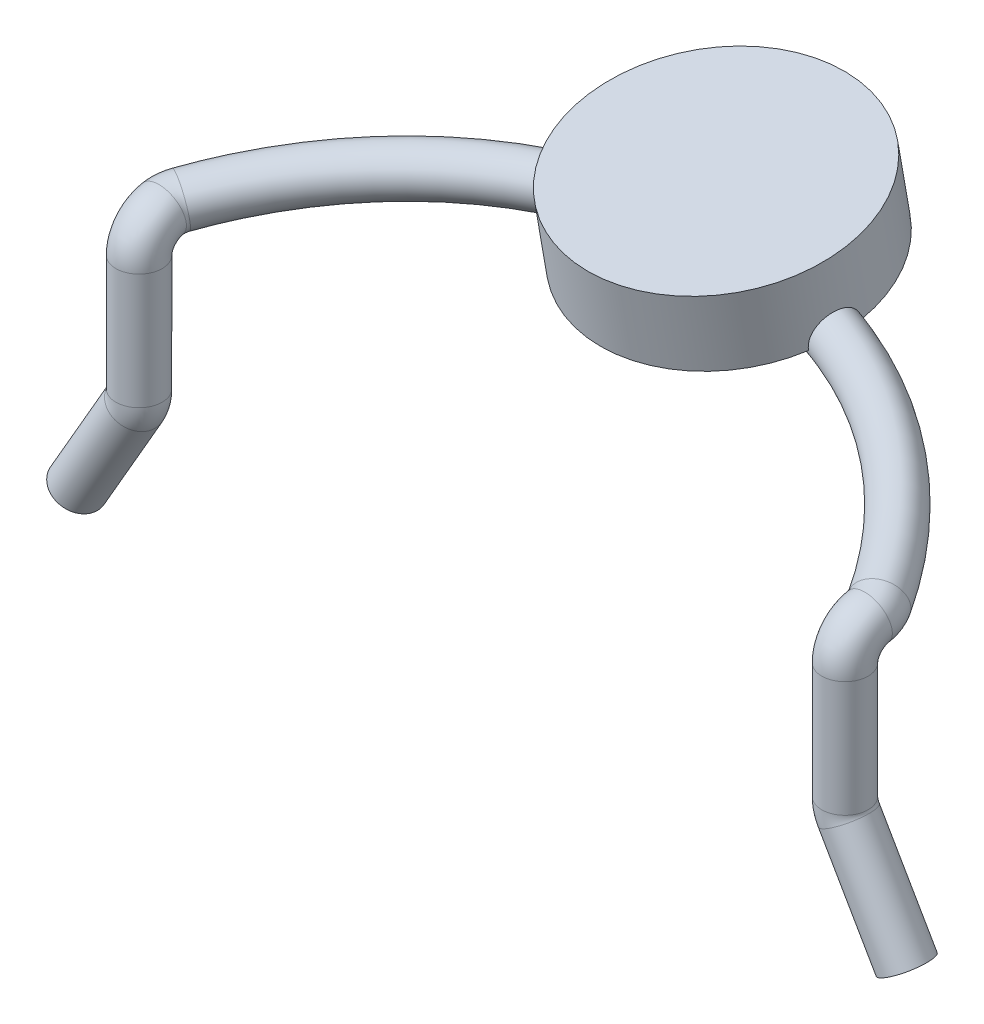
ISO-10303-21;
HEADER;
FILE_DESCRIPTION(('STEP AP214'),'2;1');
FILE_NAME('part.step','',(''),(''),'','','');
FILE_SCHEMA(('AUTOMOTIVE_DESIGN { 1 0 10303 214 1 1 1 1 }'));
ENDSEC;
DATA;
#1=APPLICATION_CONTEXT('core data for automotive mechanical design processes');
#2=APPLICATION_PROTOCOL_DEFINITION('international standard','automotive_design',2000,#1);
#3=PRODUCT_CONTEXT('',#1,'mechanical');
#4=PRODUCT('Part','Part','',(#3));
#5=PRODUCT_RELATED_PRODUCT_CATEGORY('part','',(#4));
#6=PRODUCT_DEFINITION_FORMATION('','',#4);
#7=PRODUCT_DEFINITION_CONTEXT('part definition',#1,'design');
#8=PRODUCT_DEFINITION('design','',#6,#7);
#9=PRODUCT_DEFINITION_SHAPE('','',#8);
#10=(LENGTH_UNIT() NAMED_UNIT(*) SI_UNIT(.MILLI.,.METRE.));
#11=(NAMED_UNIT(*) PLANE_ANGLE_UNIT() SI_UNIT($,.RADIAN.));
#12=(NAMED_UNIT(*) SI_UNIT($,.STERADIAN.) SOLID_ANGLE_UNIT());
#13=UNCERTAINTY_MEASURE_WITH_UNIT(LENGTH_MEASURE(1.E-05),#10,'distance_accuracy_value','');
#14=(GEOMETRIC_REPRESENTATION_CONTEXT(3) GLOBAL_UNCERTAINTY_ASSIGNED_CONTEXT((#13)) GLOBAL_UNIT_ASSIGNED_CONTEXT((#10,
#11,#12)) REPRESENTATION_CONTEXT('',''));
#15=CARTESIAN_POINT('',(0.,0.,0.));
#16=DIRECTION('',(0.,0.,1.));
#17=DIRECTION('',(1.,0.,0.));
#18=AXIS2_PLACEMENT_3D('',#15,#16,#17);
#19=CARTESIAN_POINT('',(0.,-0.0690287273675226,2.77086660812259));
#20=DIRECTION('',(0.,0.984807753012208,0.173648177666931));
#21=DIRECTION('',(0.,-0.173648177666931,0.984807753012208));
#22=AXIS2_PLACEMENT_3D('',#19,#20,#21);
#23=TOROIDAL_SURFACE('',#22,6.96632301492381,0.399999999999999);
#24=CARTESIAN_POINT('',(-6.03301270189222,0.535815920922837,-0.659377849419589));
#25=DIRECTION('',(0.500000000000001,0.150383733180433,-0.852868531952443));
#26=DIRECTION('',(-0.862679176789447,0.,-0.505751557519977));
#27=AXIS2_PLACEMENT_3D('',#24,#25,#26);
#28=CIRCLE('',#27,0.399999999999999);
#29=CARTESIAN_POINT('',(-6.378084372608,0.535815920922837,-0.861678472427579));
#30=VERTEX_POINT('',#29);
#31=EDGE_CURVE('E96',#30,#30,#28,.T.);
#32=ORIENTED_EDGE('',*,*,#31,.T.);
#33=EDGE_LOOP('',(#32));
#34=FACE_BOUND('',#33,.T.);
#35=CARTESIAN_POINT('',(6.03301270189222,0.535815920922838,-0.659377849419591));
#36=DIRECTION('',(-0.500000000000001,0.150383733180433,-0.852868531952443));
#37=DIRECTION('',(0.,0.984807753012209,0.173648177666927));
#38=AXIS2_PLACEMENT_3D('',#35,#36,#37);
#39=CIRCLE('',#38,0.4);
#40=CARTESIAN_POINT('',(6.03301270189222,0.929739022127722,-0.58991857835282));
#41=VERTEX_POINT('',#40);
#42=EDGE_CURVE('E99',#41,#41,#39,.T.);
#43=ORIENTED_EDGE('',*,*,#42,.T.);
#44=EDGE_LOOP('',(#43));
#45=FACE_BOUND('',#44,.T.);
#46=CARTESIAN_POINT('',(0.,-0.0690287273675237,2.77086660812259));
#47=DIRECTION('',(0.,0.984807753012208,0.173648177666931));
#48=DIRECTION('',(0.,-0.173648177666931,0.984807753012208));
#49=AXIS2_PLACEMENT_3D('',#46,#47,#48);
#50=CIRCLE('',#49,7.36632301492381);
#51=CARTESIAN_POINT('',(2.24948519447935,1.14901800871215,-4.13701970164975));
#52=VERTEX_POINT('',#51);
#53=CARTESIAN_POINT('',(-2.24948519447935,1.14901800871205,-4.13701970164976));
#54=VERTEX_POINT('',#53);
#55=EDGE_CURVE('E13',#52,#54,#50,.T.);
#56=ORIENTED_EDGE('',*,*,#55,.F.);
#57=CARTESIAN_POINT('',(2.1573247476109,0.749752169462648,-3.50958996476052));
#58=CARTESIAN_POINT('',(2.15278177158799,0.76263786350537,-3.49175461909945));
#59=CARTESIAN_POINT('',(2.14846760247768,0.777108318658174,-3.47501795205148));
#60=CARTESIAN_POINT('',(2.14055312925587,0.808725436458738,-3.44412574427826));
#61=CARTESIAN_POINT('',(2.13695224521209,0.825869904574168,-3.42996810744651));
#62=CARTESIAN_POINT('',(2.13071120187812,0.862371058907914,-3.40458272713638));
#63=CARTESIAN_POINT('',(2.12807139665565,0.881728556976898,-3.39335606387787));
#64=CARTESIAN_POINT('',(2.12393563335863,0.922088656960699,-3.3741182291183));
#65=CARTESIAN_POINT('',(2.12243947769324,0.943090974004952,-3.36610650227932));
#66=CARTESIAN_POINT('',(2.12069468031842,0.986184240779696,-3.35349140905993));
#67=CARTESIAN_POINT('',(2.12044817577115,1.0082769902845,-3.34889389313689));
#68=CARTESIAN_POINT('',(2.12122589865059,1.05289320655058,-3.3432560250186));
#69=CARTESIAN_POINT('',(2.12225032047465,1.07541673868428,-3.34221621709187));
#70=CARTESIAN_POINT('',(2.1254976698082,1.12025511649973,-3.3437394761664));
#71=CARTESIAN_POINT('',(2.1277206233761,1.14256995763341,-3.34630262150481));
#72=CARTESIAN_POINT('',(2.1332091394887,1.18636143774627,-3.35499015232418));
#73=CARTESIAN_POINT('',(2.13647464713826,1.20783812079143,-3.36111435031375));
#74=CARTESIAN_POINT('',(2.14382301183694,1.24934613987004,-3.37679163377904));
#75=CARTESIAN_POINT('',(2.14790566507188,1.26937783462399,-3.38634386469774));
#76=CARTESIAN_POINT('',(2.15661594519507,1.30743783329237,-3.40865423720462));
#77=CARTESIAN_POINT('',(2.16124356319067,1.325466169888,-3.42141232648388));
#78=CARTESIAN_POINT('',(2.17072667208115,1.35894225791796,-3.44975498391825));
#79=CARTESIAN_POINT('',(2.17558115261554,1.37440027105514,-3.46532776788884));
#80=CARTESIAN_POINT('',(2.18524313952745,1.4023956661811,-3.49891944976489));
#81=CARTESIAN_POINT('',(2.19005064892671,1.41493323724797,-3.51693818919232));
#82=CARTESIAN_POINT('',(2.19933166117172,1.43669739888387,-3.55482161997154));
#83=CARTESIAN_POINT('',(2.20380676270434,1.44594077627427,-3.57467628346841));
#84=CARTESIAN_POINT('',(2.2122432449772,1.46098461188158,-3.61575063862692));
#85=CARTESIAN_POINT('',(2.21620461085014,1.46678497047631,-3.63697036976648));
#86=CARTESIAN_POINT('',(2.22350131761632,1.47486012581038,-3.68034161158178));
#87=CARTESIAN_POINT('',(2.22683174369757,1.47710817144269,-3.70249891412763));
#88=CARTESIAN_POINT('',(2.23276275355579,1.47798357267372,-3.74698148450499));
#89=CARTESIAN_POINT('',(2.2353632353509,1.47661042262678,-3.76930677535951));
#90=CARTESIAN_POINT('',(2.239893936485,1.47023670911135,-3.81407112557501));
#91=CARTESIAN_POINT('',(2.24180602338132,1.46514742891848,-3.83649938642708));
#92=CARTESIAN_POINT('',(2.24493930912494,1.4513896225339,-3.88028297645663));
#93=CARTESIAN_POINT('',(2.2461603849786,1.44272045963046,-3.901638114012));
#94=CARTESIAN_POINT('',(2.24805260351387,1.42179025698144,-3.94311073975335));
#95=CARTESIAN_POINT('',(2.24871155487644,1.40945705180961,-3.96319244912482));
#96=CARTESIAN_POINT('',(2.24959925425264,1.3815634470634,-4.00098877289145));
#97=CARTESIAN_POINT('',(2.24982801574026,1.36600314858183,-4.01870346140796));
#98=CARTESIAN_POINT('',(2.25003175185178,1.33226032437556,-4.05094909031202));
#99=CARTESIAN_POINT('',(2.25001003368798,1.31411508759396,-4.06551893760898));
#100=CARTESIAN_POINT('',(2.24988054016917,1.27553672455329,-4.09122468780861));
#101=CARTESIAN_POINT('',(2.2497727956248,1.2551044196677,-4.10236181817147));
#102=CARTESIAN_POINT('',(2.24959684742265,1.21356109271617,-4.12032923545535));
#103=CARTESIAN_POINT('',(2.24952702724825,1.19252676141864,-4.12733691015293));
#104=CARTESIAN_POINT('',(2.24947177482875,1.14956004289867,-4.13757723864817));
#105=CARTESIAN_POINT('',(2.24948632426045,1.12762785169887,-4.1408107119357));
#106=CARTESIAN_POINT('',(2.24958757321707,1.08429540140439,-4.14337024225496));
#107=CARTESIAN_POINT('',(2.24967178680418,1.06290262136773,-4.14282622082209));
#108=CARTESIAN_POINT('',(2.24984603017264,1.020506140923,-4.13820614741898));
#109=CARTESIAN_POINT('',(2.24993605976779,0.999502428086936,-4.13413020846826));
#110=CARTESIAN_POINT('',(2.25001924835382,0.958133770849657,-4.12255386667144));
#111=CARTESIAN_POINT('',(2.25001097374009,0.937782630915914,-4.1150043320559));
#112=CARTESIAN_POINT('',(2.24976144201174,0.898537872152001,-4.09675062909861));
#113=CARTESIAN_POINT('',(2.24952002085076,0.879645289699323,-4.08604424322114));
#114=CARTESIAN_POINT('',(2.24864496456758,0.842906452706173,-4.06124406994105));
#115=CARTESIAN_POINT('',(2.24799308215538,0.825153774216019,-4.04701250024734));
#116=CARTESIAN_POINT('',(2.24613356638026,0.792204703228368,-4.01592264895156));
#117=CARTESIAN_POINT('',(2.24492699171636,0.777003516006902,-3.99906941148992));
#118=CARTESIAN_POINT('',(2.24286521621196,0.758588379693898,-3.97505335441053));
#119=CARTESIAN_POINT('',(2.24230323865362,0.754081537505376,-3.96883153847428));
#120=CARTESIAN_POINT('',(2.24170071351407,0.749752169462642,-3.96249662900003));
#121=B_SPLINE_CURVE_WITH_KNOTS('',3,(#57,#58,#59,#60,#61,#62,#63,#64,#65,#66,#67,#68,#69,#70,
#71,#72,#73,#74,#75,#76,#77,#78,#79,#80,#81,#82,#83,#84,#85,#86,#87,#88,#89,#90,#91,#92,#93,#94,
#95,#96,#97,#98,#99,#100,#101,#102,#103,#104,#105,#106,#107,#108,#109,#110,#111,#112,#113,#114,
#115,#116,#117,#118,#119,#120),.UNSPECIFIED.,.F.,.F.,(4,2,2,2,2,2,2,2,2,2,2,2,2,2,2,2,2,2,2,2,2,
2,2,2,2,2,2,2,2,2,2,4),(0.,0.0673085597983495,0.134562168094563,0.201840528047765,
0.269107261542413,0.336488996362734,0.403881038976148,0.471274546882545,0.538664506804786,
0.606037679080376,0.673409752122117,0.740506032773765,0.807597968204829,0.874342950436454,
0.941089863809884,1.00833706720567,1.07559366116204,1.14451068729219,1.21343997616805,
1.28382872557498,1.35421527029771,1.42367354076474,1.49310694566944,1.5592861763182,
1.62545103483923,1.68935180055017,1.75325052154527,1.81808223005194,1.88295958864397,
1.95094706186559,2.01880530786622,2.04190193460983),.UNSPECIFIED.);
#122=CARTESIAN_POINT('',(2.12065776626551,1.01009946657844,-3.34917349924001));
#123=VERTEX_POINT('',#122);
#124=EDGE_CURVE('E54',#123,#52,#121,.T.);
#125=ORIENTED_EDGE('',*,*,#124,.F.);
#126=CARTESIAN_POINT('',(0.,-0.0690287273675237,2.77086660812259));
#127=DIRECTION('',(0.,-0.984807753012208,-0.173648177666931));
#128=DIRECTION('',(0.,0.173648177666931,-0.984807753012208));
#129=AXIS2_PLACEMENT_3D('',#126,#127,#128);
#130=CIRCLE('',#129,6.56632301492381);
#131=CARTESIAN_POINT('',(-2.12065776626551,1.01009946657844,-3.34917349924001));
#132=VERTEX_POINT('',#131);
#133=EDGE_CURVE('E69',#132,#123,#130,.T.);
#134=ORIENTED_EDGE('',*,*,#133,.F.);
#135=CARTESIAN_POINT('',(-2.24170071351407,0.749752169462641,-3.96249662900003));
#136=CARTESIAN_POINT('',(-2.24353442555174,0.762878030700614,-3.98171920479837));
#137=CARTESIAN_POINT('',(-2.24498389702829,0.777626639963285,-3.99986630278733));
#138=CARTESIAN_POINT('',(-2.24725932331124,0.809938455030209,-4.03352813029822));
#139=CARTESIAN_POINT('',(-2.24808475941132,0.827503987631497,-4.04904066164909));
#140=CARTESIAN_POINT('',(-2.24925498269289,0.865010548022602,-4.07692957923547));
#141=CARTESIAN_POINT('',(-2.24959938294903,0.884953474112652,-4.08930343431037));
#142=CARTESIAN_POINT('',(-2.24998211411615,0.926660030911144,-4.11044593664168));
#143=CARTESIAN_POINT('',(-2.25002063960241,0.948422495255507,-4.119216872445));
#144=CARTESIAN_POINT('',(-2.2499622267232,0.992658221415827,-4.13263157994905));
#145=CARTESIAN_POINT('',(-2.24986829203798,1.01510478511068,-4.13736308142772));
#146=CARTESIAN_POINT('',(-2.24968171757414,1.06048438077024,-4.14277669095428));
#147=CARTESIAN_POINT('',(-2.24958907757547,1.08341732835222,-4.14345949573556));
#148=CARTESIAN_POINT('',(-2.24948618420401,1.12791609439386,-4.14075708938579));
#149=CARTESIAN_POINT('',(-2.24947213047119,1.14949400926597,-4.13756879915734));
#150=CARTESIAN_POINT('',(-2.24952563316937,1.19177959298272,-4.12753870422653));
#151=CARTESIAN_POINT('',(-2.24959317478877,1.21248741906423,-4.12069756273377));
#152=CARTESIAN_POINT('',(-2.24975906397969,1.25205359467544,-4.10376917438689));
#153=CARTESIAN_POINT('',(-2.24985679412628,1.27093985360989,-4.09374688520221));
#154=CARTESIAN_POINT('',(-2.24999137810128,1.30682728465661,-4.07076176741693));
#155=CARTESIAN_POINT('',(-2.25002822294921,1.32382817833572,-4.05779850534836));
#156=CARTESIAN_POINT('',(-2.24991839435539,1.35603201605626,-4.02891383097808));
#157=CARTESIAN_POINT('',(-2.24976618119954,1.37116570555439,-4.01291532930681));
#158=CARTESIAN_POINT('',(-2.2491241933024,1.39869223329608,-3.97871856704829));
#159=CARTESIAN_POINT('',(-2.24863433611179,1.41108440111071,-3.96051977006602));
#160=CARTESIAN_POINT('',(-2.24714290219715,1.4333911029307,-3.92151470529671));
#161=CARTESIAN_POINT('',(-2.24611801975162,1.44315916933791,-3.90062544759092));
#162=CARTESIAN_POINT('',(-2.24341077784819,1.45917571495374,-3.85757663557944));
#163=CARTESIAN_POINT('',(-2.24172831685766,1.46542365027681,-3.83541688555599));
#164=CARTESIAN_POINT('',(-2.23757179462144,1.47432579454485,-3.78995097388689));
#165=CARTESIAN_POINT('',(-2.23508135016454,1.47689908969391,-3.76663037049484));
#166=CARTESIAN_POINT('',(-2.2292926296209,1.47808477108217,-3.7199875306988));
#167=CARTESIAN_POINT('',(-2.22599442818855,1.47669752323592,-3.69666529464472));
#168=CARTESIAN_POINT('',(-2.21870394116425,1.47000366104253,-3.65108680957837));
#169=CARTESIAN_POINT('',(-2.21472348493758,1.46475951492384,-3.62881952392643));
#170=CARTESIAN_POINT('',(-2.20617300753853,1.45052411561776,-3.58563719533127));
#171=CARTESIAN_POINT('',(-2.20160308276283,1.44153347456534,-3.56472193212742));
#172=CARTESIAN_POINT('',(-2.19221991901123,1.42031975030378,-3.52540707880522));
#173=CARTESIAN_POINT('',(-2.18741633249669,1.40818860538832,-3.50695552441315));
#174=CARTESIAN_POINT('',(-2.17771989481273,1.38091711951076,-3.47245664714769));
#175=CARTESIAN_POINT('',(-2.17282704825451,1.36577693359902,-3.45640920046973));
#176=CARTESIAN_POINT('',(-2.16329728357924,1.33308544243247,-3.42730874046914));
#177=CARTESIAN_POINT('',(-2.15865820479205,1.31556135293903,-3.41422583127395));
#178=CARTESIAN_POINT('',(-2.1498715120115,1.27846713852976,-3.39116504949774));
#179=CARTESIAN_POINT('',(-2.14572389724439,1.25889701683523,-3.38118717202822));
#180=CARTESIAN_POINT('',(-2.13817508429436,1.21816618523802,-3.36453349134945));
#181=CARTESIAN_POINT('',(-2.13477708744773,1.1969991524559,-3.3578717034892));
#182=CARTESIAN_POINT('',(-2.1289796101282,1.15373380437577,-3.34805557210635));
#183=CARTESIAN_POINT('',(-2.1265802214091,1.13163540370744,-3.34490155083876));
#184=CARTESIAN_POINT('',(-2.12293768531615,1.08701748835967,-3.34215101247519));
#185=CARTESIAN_POINT('',(-2.1217000914677,1.06449647068742,-3.34257148672424));
#186=CARTESIAN_POINT('',(-2.12048853201111,1.01977616573545,-3.34698044479389));
#187=CARTESIAN_POINT('',(-2.12051434105968,0.997576821787865,-3.35096829220548));
#188=CARTESIAN_POINT('',(-2.1218278758661,0.954113181613587,-3.36240231355644));
#189=CARTESIAN_POINT('',(-2.12311628247376,0.932849396346957,-3.36985035224804));
#190=CARTESIAN_POINT('',(-2.12686418930719,0.891869915652821,-3.38801228775624));
#191=CARTESIAN_POINT('',(-2.12932406559257,0.872154719715277,-3.39872723290191));
#192=CARTESIAN_POINT('',(-2.13549018934265,0.833320279276351,-3.42416220166719));
#193=CARTESIAN_POINT('',(-2.13928186513295,0.814381407602578,-3.43913797038177));
#194=CARTESIAN_POINT('',(-2.1477320355273,0.779583881910314,-3.47216983513132));
#195=CARTESIAN_POINT('',(-2.15239196086129,0.763730401553347,-3.49023101125696));
#196=CARTESIAN_POINT('',(-2.1573247476109,0.749752169462648,-3.50958996476052));
#197=B_SPLINE_CURVE_WITH_KNOTS('',3,(#135,#136,#137,#138,#139,#140,#141,#142,#143,#144,#145,
#146,#147,#148,#149,#150,#151,#152,#153,#154,#155,#156,#157,#158,#159,#160,#161,#162,#163,#164,
#165,#166,#167,#168,#169,#170,#171,#172,#173,#174,#175,#176,#177,#178,#179,#180,#181,#182,#183,
#184,#185,#186,#187,#188,#189,#190,#191,#192,#193,#194,#195,#196),.UNSPECIFIED.,.F.,.F.,(4,2,2,
2,2,2,2,2,2,2,2,2,2,2,2,2,2,2,2,2,2,2,2,2,2,2,2,2,2,2,4),(0.,0.0699612079018656,
0.139980504724802,0.210056089805949,0.280087094322323,0.348555362982973,0.417011848712369,
0.482127182590311,0.547230698183345,0.611082175628445,0.674943070219933,0.740720137226627,
0.806513272032734,0.875446333618777,0.944390042939382,1.01482961389304,1.0852626771458,
1.15457941612615,1.22388483397209,1.29135431416069,1.3588203186718,1.42557225176233,
1.4923240797592,1.55935568634555,1.62639345055014,1.69375005594181,1.76109464750672,
1.82847557432089,1.89587814603446,1.96878904081854,2.04182116050583),.UNSPECIFIED.);
#198=EDGE_CURVE('E64',#54,#132,#197,.T.);
#199=ORIENTED_EDGE('',*,*,#198,.F.);
#200=EDGE_LOOP('',(#56,#125,#134,#199));
#201=FACE_BOUND('',#200,.T.);
#202=ADVANCED_FACE('F46',(#34,#45,#201),#23,.T.);
#203=CARTESIAN_POINT('',(6.1,-2.,0.));
#204=DIRECTION('',(0.,1.,0.));
#205=DIRECTION('',(0.,0.,1.));
#206=AXIS2_PLACEMENT_3D('',#203,#204,#205);
#207=CYLINDRICAL_SURFACE('',#206,0.4);
#208=CARTESIAN_POINT('',(6.1,-2.,0.));
#209=DIRECTION('',(0.,-1.,0.));
#210=DIRECTION('',(0.,0.,-1.));
#211=AXIS2_PLACEMENT_3D('',#208,#209,#210);
#212=CIRCLE('',#211,0.4);
#213=CARTESIAN_POINT('',(5.7,-2.,0.));
#214=VERTEX_POINT('',#213);
#215=EDGE_CURVE('E86',#214,#214,#212,.T.);
#216=ORIENTED_EDGE('',*,*,#215,.F.);
#217=EDGE_LOOP('',(#216));
#218=FACE_BOUND('',#217,.T.);
#219=CARTESIAN_POINT('',(6.1,0.,0.));
#220=DIRECTION('',(0.,1.,0.));
#221=DIRECTION('',(0.,0.,1.));
#222=AXIS2_PLACEMENT_3D('',#219,#220,#221);
#223=CIRCLE('',#222,0.4);
#224=CARTESIAN_POINT('',(6.1,0.,0.400000000000001));
#225=VERTEX_POINT('',#224);
#226=EDGE_CURVE('E78',#225,#225,#223,.T.);
#227=ORIENTED_EDGE('',*,*,#226,.F.);
#228=EDGE_LOOP('',(#227));
#229=FACE_BOUND('',#228,.T.);
#230=ADVANCED_FACE('F48',(#218,#229),#207,.T.);
#231=CARTESIAN_POINT('',(6.1,0.,-0.500000000000002));
#232=DIRECTION('',(1.,0.,0.));
#233=DIRECTION('',(0.,0.,-1.));
#234=AXIS2_PLACEMENT_3D('',#231,#232,#233);
#235=TOROIDAL_SURFACE('',#234,0.500000000000002,0.4);
#236=CARTESIAN_POINT('',(6.1,0.492403876506106,-0.413175911166538));
#237=DIRECTION('',(0.,0.173648177666927,-0.984807753012209));
#238=DIRECTION('',(0.,0.984807753012209,0.173648177666927));
#239=AXIS2_PLACEMENT_3D('',#236,#237,#238);
#240=CIRCLE('',#239,0.4);
#241=CARTESIAN_POINT('',(6.1,0.88632697771099,-0.343716640099767));
#242=VERTEX_POINT('',#241);
#243=EDGE_CURVE('E102',#242,#242,#240,.T.);
#244=CARTESIAN_POINT('',(6.1,0.,-0.500000000000002));
#245=DIRECTION('',(1.,0.,0.));
#246=DIRECTION('',(0.,0.,-1.));
#247=AXIS2_PLACEMENT_3D('',#244,#245,#246);
#248=CIRCLE('',#247,0.900000000000002);
#249=EDGE_CURVE('',#242,#225,#248,.T.);
#250=ORIENTED_EDGE('',*,*,#243,.F.);
#251=ORIENTED_EDGE('',*,*,#226,.T.);
#252=ORIENTED_EDGE('',*,*,#249,.T.);
#253=ORIENTED_EDGE('',*,*,#249,.F.);
#254=EDGE_LOOP('',(#250,#252,#251,#253));
#255=FACE_BOUND('',#254,.T.);
#256=ADVANCED_FACE('F142',(#255),#235,.T.);
#257=CARTESIAN_POINT('',(5.6,0.492403876506106,-0.413175911166538));
#258=DIRECTION('',(0.,-0.984807753012209,-0.173648177666927));
#259=DIRECTION('',(0.,0.173648177666927,-0.984807753012209));
#260=AXIS2_PLACEMENT_3D('',#257,#258,#259);
#261=TOROIDAL_SURFACE('',#260,0.500000000000001,0.4);
#262=ORIENTED_EDGE('',*,*,#42,.F.);
#263=EDGE_LOOP('',(#262));
#264=FACE_BOUND('',#263,.T.);
#265=ORIENTED_EDGE('',*,*,#243,.T.);
#266=EDGE_LOOP('',(#265));
#267=FACE_BOUND('',#266,.T.);
#268=ADVANCED_FACE('F137',(#264,#267),#261,.T.);
#269=CARTESIAN_POINT('',(-6.1,-2.,0.));
#270=DIRECTION('',(0.,1.,0.));
#271=DIRECTION('',(0.,0.,1.));
#272=AXIS2_PLACEMENT_3D('',#269,#270,#271);
#273=CYLINDRICAL_SURFACE('',#272,0.399999999999998);
#274=CARTESIAN_POINT('',(-6.1,-2.,0.));
#275=DIRECTION('',(0.,1.,0.));
#276=DIRECTION('',(0.,0.,-1.));
#277=AXIS2_PLACEMENT_3D('',#274,#275,#276);
#278=CIRCLE('',#277,0.4);
#279=CARTESIAN_POINT('',(-5.7,-2.,0.));
#280=VERTEX_POINT('',#279);
#281=EDGE_CURVE('E287',#280,#280,#278,.T.);
#282=ORIENTED_EDGE('',*,*,#281,.T.);
#283=EDGE_LOOP('',(#282));
#284=FACE_BOUND('',#283,.T.);
#285=CARTESIAN_POINT('',(-6.1,0.,0.));
#286=DIRECTION('',(0.,1.,0.));
#287=DIRECTION('',(0.,0.,1.));
#288=AXIS2_PLACEMENT_3D('',#285,#286,#287);
#289=CIRCLE('',#288,0.399999999999998);
#290=CARTESIAN_POINT('',(-6.1,0.,0.399999999999998));
#291=VERTEX_POINT('',#290);
#292=EDGE_CURVE('E93',#291,#291,#289,.T.);
#293=ORIENTED_EDGE('',*,*,#292,.F.);
#294=EDGE_LOOP('',(#293));
#295=FACE_BOUND('',#294,.T.);
#296=ADVANCED_FACE('F134',(#284,#295),#273,.T.);
#297=CARTESIAN_POINT('',(-6.1,0.,-0.5));
#298=DIRECTION('',(1.,0.,0.));
#299=DIRECTION('',(0.,0.,-1.));
#300=AXIS2_PLACEMENT_3D('',#297,#298,#299);
#301=TOROIDAL_SURFACE('',#300,0.5,0.399999999999998);
#302=CARTESIAN_POINT('',(-6.1,0.492403876506104,-0.413175911166536));
#303=DIRECTION('',(0.,0.173648177666927,-0.984807753012209));
#304=DIRECTION('',(0.,0.984807753012209,0.173648177666927));
#305=AXIS2_PLACEMENT_3D('',#302,#303,#304);
#306=CIRCLE('',#305,0.399999999999998);
#307=CARTESIAN_POINT('',(-6.1,0.886326977710986,-0.343716640099766));
#308=VERTEX_POINT('',#307);
#309=EDGE_CURVE('E90',#308,#308,#306,.T.);
#310=CARTESIAN_POINT('',(-6.1,0.,-0.5));
#311=DIRECTION('',(1.,0.,0.));
#312=DIRECTION('',(0.,0.,-1.));
#313=AXIS2_PLACEMENT_3D('',#310,#311,#312);
#314=CIRCLE('',#313,0.899999999999998);
#315=EDGE_CURVE('',#308,#291,#314,.T.);
#316=ORIENTED_EDGE('',*,*,#309,.F.);
#317=ORIENTED_EDGE('',*,*,#292,.T.);
#318=ORIENTED_EDGE('',*,*,#315,.T.);
#319=ORIENTED_EDGE('',*,*,#315,.F.);
#320=EDGE_LOOP('',(#316,#318,#317,#319));
#321=FACE_BOUND('',#320,.T.);
#322=ADVANCED_FACE('F131',(#321),#301,.T.);
#323=CARTESIAN_POINT('',(-5.6,0.492403876506104,-0.413175911166536));
#324=DIRECTION('',(0.,0.984807753012209,0.173648177666927));
#325=DIRECTION('',(0.,-0.173648177666927,0.984807753012209));
#326=AXIS2_PLACEMENT_3D('',#323,#324,#325);
#327=TOROIDAL_SURFACE('',#326,0.500000000000001,0.399999999999998);
#328=ORIENTED_EDGE('',*,*,#31,.F.);
#329=EDGE_LOOP('',(#328));
#330=FACE_BOUND('',#329,.T.);
#331=ORIENTED_EDGE('',*,*,#309,.T.);
#332=EDGE_LOOP('',(#331));
#333=FACE_BOUND('',#332,.T.);
#334=ADVANCED_FACE('F125',(#330,#333),#327,.T.);
#335=CARTESIAN_POINT('',(0.,2.37167026047846,-3.8725620848781));
#336=DIRECTION('',(0.,-0.984807753012208,-0.173648177666931));
#337=DIRECTION('',(0.,0.173648177666931,-0.984807753012208));
#338=AXIS2_PLACEMENT_3D('',#335,#336,#337);
#339=CYLINDRICAL_SURFACE('',#338,2.25);
#340=CARTESIAN_POINT('',(0.,2.37167026047846,-3.8725620848781));
#341=DIRECTION('',(0.,0.984807753012208,0.173648177666931));
#342=DIRECTION('',(0.,-0.173648177666931,0.984807753012208));
#343=AXIS2_PLACEMENT_3D('',#340,#341,#342);
#344=CIRCLE('',#343,2.25);
#345=CARTESIAN_POINT('',(0.,1.98096186072786,-1.65674464060063));
#346=VERTEX_POINT('',#345);
#347=EDGE_CURVE('E84',#346,#346,#344,.T.);
#348=ORIENTED_EDGE('',*,*,#347,.F.);
#349=EDGE_LOOP('',(#348));
#350=FACE_BOUND('',#349,.T.);
#351=CARTESIAN_POINT('',(0.,1.1406605692132,-4.08962230696176));
#352=DIRECTION('',(0.,0.984807753012208,0.173648177666931));
#353=DIRECTION('',(0.,-0.173648177666931,0.984807753012208));
#354=AXIS2_PLACEMENT_3D('',#351,#352,#353);
#355=CIRCLE('',#354,2.25);
#356=EDGE_CURVE('E77',#132,#123,#355,.T.);
#357=ORIENTED_EDGE('',*,*,#356,.T.);
#358=ORIENTED_EDGE('',*,*,#124,.T.);
#359=EDGE_CURVE('E81',#52,#54,#355,.T.);
#360=ORIENTED_EDGE('',*,*,#359,.T.);
#361=ORIENTED_EDGE('',*,*,#198,.T.);
#362=EDGE_LOOP('',(#357,#358,#360,#361));
#363=FACE_BOUND('',#362,.T.);
#364=ADVANCED_FACE('F80',(#350,#363),#339,.T.);
#365=CARTESIAN_POINT('',(0.,1.1406605692132,-4.08962230696176));
#366=DIRECTION('',(0.,0.984807753012208,0.173648177666931));
#367=DIRECTION('',(0.,-0.173648177666931,0.984807753012208));
#368=AXIS2_PLACEMENT_3D('',#365,#366,#367);
#369=PLANE('',#368);
#370=ORIENTED_EDGE('',*,*,#359,.F.);
#371=ORIENTED_EDGE('',*,*,#55,.T.);
#372=EDGE_LOOP('',(#370,#371));
#373=FACE_BOUND('',#372,.T.);
#374=ADVANCED_FACE('F124',(#373),#369,.F.);
#375=ORIENTED_EDGE('',*,*,#356,.F.);
#376=ORIENTED_EDGE('',*,*,#133,.T.);
#377=EDGE_LOOP('',(#375,#376));
#378=FACE_BOUND('',#377,.T.);
#379=ADVANCED_FACE('F76',(#378),#369,.F.);
#380=CARTESIAN_POINT('',(0.,2.37167026047846,-3.8725620848781));
#381=DIRECTION('',(0.,0.984807753012208,0.173648177666931));
#382=DIRECTION('',(0.,-0.173648177666931,0.984807753012208));
#383=AXIS2_PLACEMENT_3D('',#380,#381,#382);
#384=PLANE('',#383);
#385=ORIENTED_EDGE('',*,*,#347,.T.);
#386=EDGE_LOOP('',(#385));
#387=FACE_BOUND('',#386,.T.);
#388=ADVANCED_FACE('F213',(#387),#384,.T.);
#389=CARTESIAN_POINT('',(6.6,-2.,0.));
#390=DIRECTION('',(0.,0.,-1.));
#391=DIRECTION('',(-1.,0.,0.));
#392=AXIS2_PLACEMENT_3D('',#389,#390,#391);
#393=TOROIDAL_SURFACE('',#392,0.500000000000001,0.4);
#394=CARTESIAN_POINT('',(6.16698729810778,-2.25,0.));
#395=DIRECTION('',(0.500000000000001,-0.866025403784438,0.));
#396=DIRECTION('',(0.,0.,-1.));
#397=AXIS2_PLACEMENT_3D('',#394,#395,#396);
#398=CIRCLE('',#397,0.4);
#399=CARTESIAN_POINT('',(5.820577136594,-2.45,0.));
#400=VERTEX_POINT('',#399);
#401=EDGE_CURVE('E82',#400,#400,#398,.T.);
#402=CARTESIAN_POINT('',(6.6,-2.,0.));
#403=DIRECTION('',(0.,0.,-1.));
#404=DIRECTION('',(-1.,0.,0.));
#405=AXIS2_PLACEMENT_3D('',#402,#403,#404);
#406=CIRCLE('',#405,0.900000000000001);
#407=EDGE_CURVE('',#400,#214,#406,.T.);
#408=ORIENTED_EDGE('',*,*,#401,.F.);
#409=ORIENTED_EDGE('',*,*,#215,.T.);
#410=ORIENTED_EDGE('',*,*,#407,.T.);
#411=ORIENTED_EDGE('',*,*,#407,.F.);
#412=EDGE_LOOP('',(#408,#410,#409,#411));
#413=FACE_BOUND('',#412,.T.);
#414=ADVANCED_FACE('F221',(#413),#393,.T.);
#415=CARTESIAN_POINT('',(7.16698729810778,-3.98205080756888,0.));
#416=DIRECTION('',(-0.500000000000001,0.866025403784438,0.));
#417=DIRECTION('',(-0.866025403784438,-0.500000000000001,0.));
#418=AXIS2_PLACEMENT_3D('',#415,#416,#417);
#419=CYLINDRICAL_SURFACE('',#418,0.4);
#420=CARTESIAN_POINT('',(7.16698729810778,-3.98205080756888,0.));
#421=DIRECTION('',(0.500000000000001,-0.866025403784438,0.));
#422=DIRECTION('',(0.866025403784438,0.500000000000001,0.));
#423=AXIS2_PLACEMENT_3D('',#420,#421,#422);
#424=CIRCLE('',#423,0.4);
#425=CARTESIAN_POINT('',(7.51339745962156,-3.78205080756888,0.));
#426=VERTEX_POINT('',#425);
#427=EDGE_CURVE('E290',#426,#426,#424,.T.);
#428=ORIENTED_EDGE('',*,*,#427,.F.);
#429=EDGE_LOOP('',(#428));
#430=FACE_BOUND('',#429,.T.);
#431=ORIENTED_EDGE('',*,*,#401,.T.);
#432=EDGE_LOOP('',(#431));
#433=FACE_BOUND('',#432,.T.);
#434=ADVANCED_FACE('F230',(#430,#433),#419,.T.);
#435=CARTESIAN_POINT('',(7.16698729810778,-3.98205080756888,0.));
#436=DIRECTION('',(0.500000000000001,-0.866025403784438,0.));
#437=DIRECTION('',(0.866025403784438,0.500000000000001,0.));
#438=AXIS2_PLACEMENT_3D('',#435,#436,#437);
#439=PLANE('',#438);
#440=ORIENTED_EDGE('',*,*,#427,.T.);
#441=EDGE_LOOP('',(#440));
#442=FACE_BOUND('',#441,.T.);
#443=ADVANCED_FACE('F240',(#442),#439,.T.);
#444=CARTESIAN_POINT('',(-6.6,-2.,0.));
#445=DIRECTION('',(0.,0.,-1.));
#446=DIRECTION('',(1.,0.,0.));
#447=AXIS2_PLACEMENT_3D('',#444,#445,#446);
#448=TOROIDAL_SURFACE('',#447,0.500000000000001,0.4);
#449=CARTESIAN_POINT('',(-6.16698729810778,-2.25,0.));
#450=DIRECTION('',(0.500000000000001,0.866025403784438,0.));
#451=DIRECTION('',(-0.866025403784438,0.500000000000001,0.));
#452=AXIS2_PLACEMENT_3D('',#449,#450,#451);
#453=CIRCLE('',#452,0.4);
#454=CARTESIAN_POINT('',(-5.820577136594,-2.45,0.));
#455=VERTEX_POINT('',#454);
#456=EDGE_CURVE('E288',#455,#455,#453,.T.);
#457=CARTESIAN_POINT('',(-6.6,-2.,0.));
#458=DIRECTION('',(0.,0.,-1.));
#459=DIRECTION('',(1.,0.,0.));
#460=AXIS2_PLACEMENT_3D('',#457,#458,#459);
#461=CIRCLE('',#460,0.900000000000001);
#462=EDGE_CURVE('',#280,#455,#461,.T.);
#463=ORIENTED_EDGE('',*,*,#281,.F.);
#464=ORIENTED_EDGE('',*,*,#456,.T.);
#465=ORIENTED_EDGE('',*,*,#462,.T.);
#466=ORIENTED_EDGE('',*,*,#462,.F.);
#467=EDGE_LOOP('',(#463,#465,#464,#466));
#468=FACE_BOUND('',#467,.T.);
#469=ADVANCED_FACE('F250',(#468),#448,.T.);
#470=CARTESIAN_POINT('',(-7.16698729810778,-3.98205080756888,0.));
#471=DIRECTION('',(0.500000000000001,0.866025403784438,0.));
#472=DIRECTION('',(-0.866025403784438,0.500000000000001,0.));
#473=AXIS2_PLACEMENT_3D('',#470,#471,#472);
#474=CYLINDRICAL_SURFACE('',#473,0.4);
#475=CARTESIAN_POINT('',(-7.16698729810778,-3.98205080756888,0.));
#476=DIRECTION('',(0.500000000000001,0.866025403784438,0.));
#477=DIRECTION('',(-0.866025403784438,0.500000000000001,0.));
#478=AXIS2_PLACEMENT_3D('',#475,#476,#477);
#479=CIRCLE('',#478,0.4);
#480=CARTESIAN_POINT('',(-7.51339745962156,-3.78205080756888,0.));
#481=VERTEX_POINT('',#480);
#482=EDGE_CURVE('E286',#481,#481,#479,.T.);
#483=ORIENTED_EDGE('',*,*,#482,.T.);
#484=EDGE_LOOP('',(#483));
#485=FACE_BOUND('',#484,.T.);
#486=ORIENTED_EDGE('',*,*,#456,.F.);
#487=EDGE_LOOP('',(#486));
#488=FACE_BOUND('',#487,.T.);
#489=ADVANCED_FACE('F260',(#485,#488),#474,.T.);
#490=CARTESIAN_POINT('',(-7.16698729810778,-3.98205080756888,0.));
#491=DIRECTION('',(-0.500000000000001,-0.866025403784438,0.));
#492=DIRECTION('',(-0.866025403784438,0.500000000000001,0.));
#493=AXIS2_PLACEMENT_3D('',#490,#491,#492);
#494=PLANE('',#493);
#495=ORIENTED_EDGE('',*,*,#482,.F.);
#496=EDGE_LOOP('',(#495));
#497=FACE_BOUND('',#496,.T.);
#498=ADVANCED_FACE('F270',(#497),#494,.T.);
#499=CLOSED_SHELL('',(#202,#230,#256,#268,#296,#322,#334,#364,#374,#379,#388,#414,#434,#443,
#469,#489,#498));
#500=MANIFOLD_SOLID_BREP('B2',#499);
#501=ADVANCED_BREP_SHAPE_REPRESENTATION('',(#18,#500),#14);
#502=SHAPE_DEFINITION_REPRESENTATION(#9,#501);
ENDSEC;
END-ISO-10303-21;
